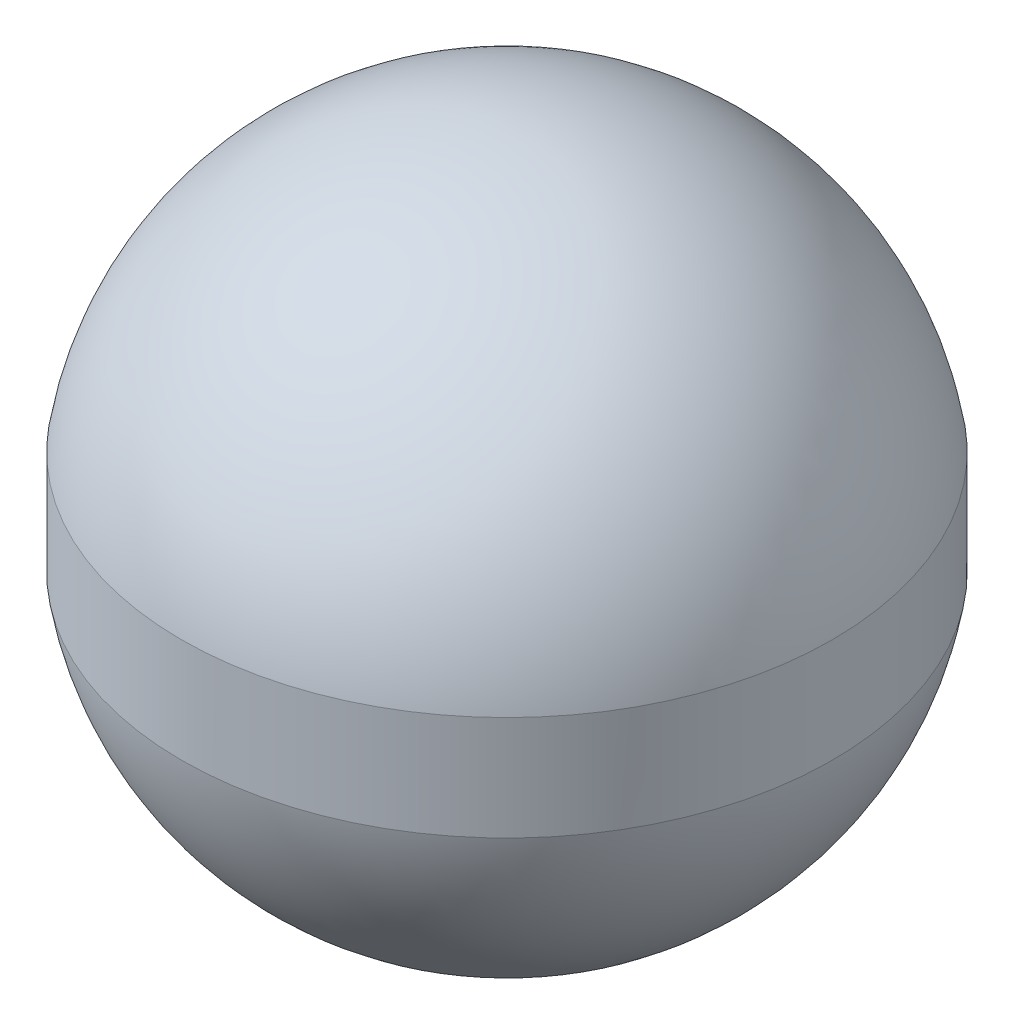
ISO-10303-21;
HEADER;
FILE_DESCRIPTION(('STEP AP214'),'2;1');
FILE_NAME('part.step','',(''),(''),'','','');
FILE_SCHEMA(('AUTOMOTIVE_DESIGN { 1 0 10303 214 1 1 1 1 }'));
ENDSEC;
DATA;
#1=APPLICATION_CONTEXT('core data for automotive mechanical design processes');
#2=APPLICATION_PROTOCOL_DEFINITION('international standard','automotive_design',2000,#1);
#3=PRODUCT_CONTEXT('',#1,'mechanical');
#4=PRODUCT('Part','Part','',(#3));
#5=PRODUCT_RELATED_PRODUCT_CATEGORY('part','',(#4));
#6=PRODUCT_DEFINITION_FORMATION('','',#4);
#7=PRODUCT_DEFINITION_CONTEXT('part definition',#1,'design');
#8=PRODUCT_DEFINITION('design','',#6,#7);
#9=PRODUCT_DEFINITION_SHAPE('','',#8);
#10=(LENGTH_UNIT() NAMED_UNIT(*) SI_UNIT(.MILLI.,.METRE.));
#11=(NAMED_UNIT(*) PLANE_ANGLE_UNIT() SI_UNIT($,.RADIAN.));
#12=(NAMED_UNIT(*) SI_UNIT($,.STERADIAN.) SOLID_ANGLE_UNIT());
#13=UNCERTAINTY_MEASURE_WITH_UNIT(LENGTH_MEASURE(1.E-05),#10,'distance_accuracy_value','');
#14=(GEOMETRIC_REPRESENTATION_CONTEXT(3) GLOBAL_UNCERTAINTY_ASSIGNED_CONTEXT((#13)) GLOBAL_UNIT_ASSIGNED_CONTEXT((#10,
#11,#12)) REPRESENTATION_CONTEXT('',''));
#15=CARTESIAN_POINT('',(0.,0.,0.));
#16=DIRECTION('',(0.,0.,1.));
#17=DIRECTION('',(1.,0.,0.));
#18=AXIS2_PLACEMENT_3D('',#15,#16,#17);
#19=CARTESIAN_POINT('',(0.,7.9375,0.));
#20=DIRECTION('',(0.,1.,0.));
#21=DIRECTION('',(0.,0.,1.));
#22=AXIS2_PLACEMENT_3D('',#19,#20,#21);
#23=CYLINDRICAL_SURFACE('',#22,7.8375);
#24=CARTESIAN_POINT('',(0.,-1.25598566870804,0.));
#25=DIRECTION('',(0.,1.,0.));
#26=DIRECTION('',(0.,0.,1.));
#27=AXIS2_PLACEMENT_3D('',#24,#25,#26);
#28=CIRCLE('',#27,7.8375);
#29=CARTESIAN_POINT('',(0.,-1.25598566870804,7.8375));
#30=VERTEX_POINT('',#29);
#31=EDGE_CURVE('E47',#30,#30,#28,.T.);
#32=ORIENTED_EDGE('',*,*,#31,.T.);
#33=EDGE_LOOP('',(#32));
#34=FACE_BOUND('',#33,.T.);
#35=CARTESIAN_POINT('',(0.,1.25598566870804,0.));
#36=DIRECTION('',(0.,1.,0.));
#37=DIRECTION('',(0.,0.,1.));
#38=AXIS2_PLACEMENT_3D('',#35,#36,#37);
#39=CIRCLE('',#38,7.8375);
#40=CARTESIAN_POINT('',(0.,1.25598566870804,7.8375));
#41=VERTEX_POINT('',#40);
#42=EDGE_CURVE('E10',#41,#41,#39,.T.);
#43=ORIENTED_EDGE('',*,*,#42,.F.);
#44=EDGE_LOOP('',(#43));
#45=FACE_BOUND('',#44,.T.);
#46=ADVANCED_FACE('F37',(#34,#45),#23,.T.);
#47=CARTESIAN_POINT('',(0.,0.,0.));
#48=DIRECTION('',(0.,1.,0.));
#49=DIRECTION('',(1.,0.,0.));
#50=AXIS2_PLACEMENT_3D('',#47,#48,#49);
#51=SPHERICAL_SURFACE('',#50,7.9375);
#52=ORIENTED_EDGE('',*,*,#42,.T.);
#53=EDGE_LOOP('',(#52));
#54=FACE_BOUND('',#53,.T.);
#55=ADVANCED_FACE('F60',(#54),#51,.T.);
#56=CARTESIAN_POINT('',(0.,-7.9365,0.));
#57=DIRECTION('',(0.,1.,0.));
#58=DIRECTION('',(0.,0.,1.));
#59=AXIS2_PLACEMENT_3D('',#56,#57,#58);
#60=PLANE('',#59);
#61=CARTESIAN_POINT('',(0.,-7.9365,0.));
#62=DIRECTION('',(0.,1.,0.));
#63=DIRECTION('',(0.,0.,1.));
#64=AXIS2_PLACEMENT_3D('',#61,#62,#63);
#65=CIRCLE('',#64,0.125992063242047);
#66=CARTESIAN_POINT('',(0.,-7.9365,0.125992063242047));
#67=VERTEX_POINT('',#66);
#68=EDGE_CURVE('E43',#67,#67,#65,.T.);
#69=ORIENTED_EDGE('',*,*,#68,.F.);
#70=EDGE_LOOP('',(#69));
#71=FACE_BOUND('',#70,.T.);
#72=ADVANCED_FACE('F58',(#71),#60,.F.);
#73=ORIENTED_EDGE('',*,*,#31,.F.);
#74=EDGE_LOOP('',(#73));
#75=FACE_BOUND('',#74,.T.);
#76=ORIENTED_EDGE('',*,*,#68,.T.);
#77=EDGE_LOOP('',(#76));
#78=FACE_BOUND('',#77,.T.);
#79=ADVANCED_FACE('F56',(#75,#78),#51,.T.);
#80=CLOSED_SHELL('',(#46,#55,#72,#79));
#81=MANIFOLD_SOLID_BREP('B2',#80);
#82=ADVANCED_BREP_SHAPE_REPRESENTATION('',(#18,#81),#14);
#83=SHAPE_DEFINITION_REPRESENTATION(#9,#82);
ENDSEC;
END-ISO-10303-21;
